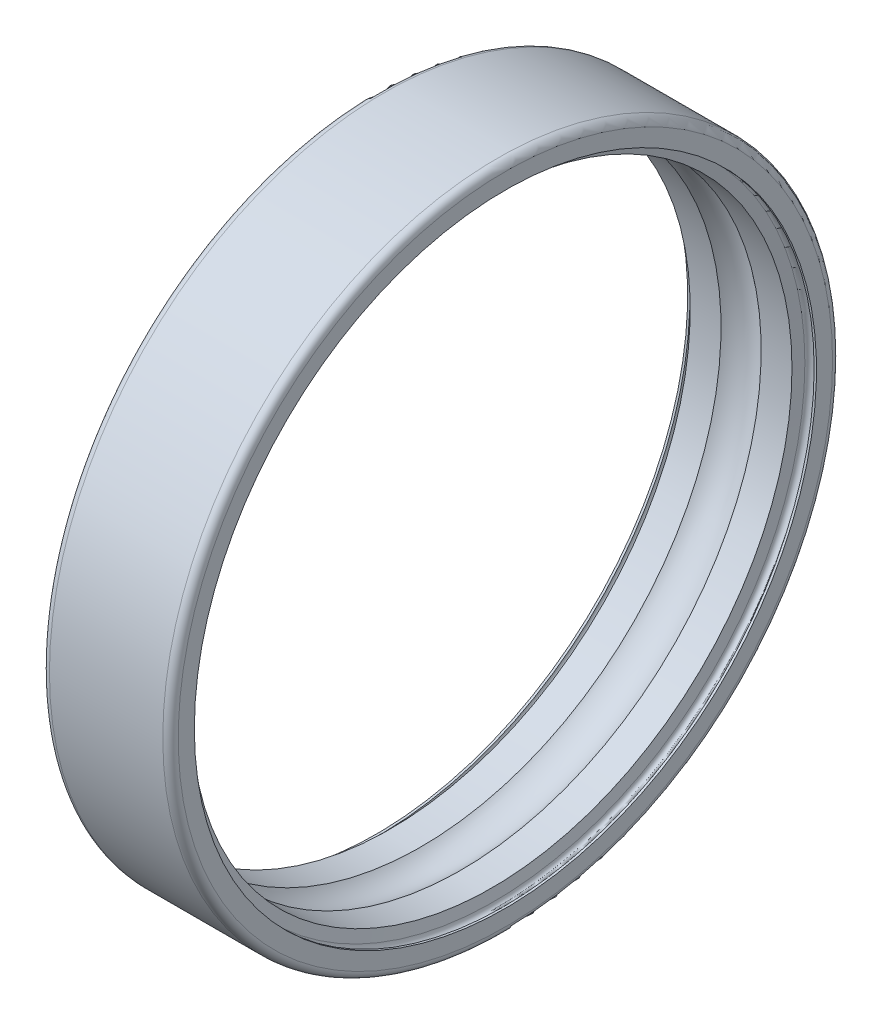
ISO-10303-21;
HEADER;
FILE_DESCRIPTION(('STEP AP214'),'2;1');
FILE_NAME('part.step','',(''),(''),'','','');
FILE_SCHEMA(('AUTOMOTIVE_DESIGN { 1 0 10303 214 1 1 1 1 }'));
ENDSEC;
DATA;
#1=APPLICATION_CONTEXT('core data for automotive mechanical design processes');
#2=APPLICATION_PROTOCOL_DEFINITION('international standard','automotive_design',2000,#1);
#3=PRODUCT_CONTEXT('',#1,'mechanical');
#4=PRODUCT('Part','Part','',(#3));
#5=PRODUCT_RELATED_PRODUCT_CATEGORY('part','',(#4));
#6=PRODUCT_DEFINITION_FORMATION('','',#4);
#7=PRODUCT_DEFINITION_CONTEXT('part definition',#1,'design');
#8=PRODUCT_DEFINITION('design','',#6,#7);
#9=PRODUCT_DEFINITION_SHAPE('','',#8);
#10=(LENGTH_UNIT() NAMED_UNIT(*) SI_UNIT(.MILLI.,.METRE.));
#11=(NAMED_UNIT(*) PLANE_ANGLE_UNIT() SI_UNIT($,.RADIAN.));
#12=(NAMED_UNIT(*) SI_UNIT($,.STERADIAN.) SOLID_ANGLE_UNIT());
#13=UNCERTAINTY_MEASURE_WITH_UNIT(LENGTH_MEASURE(1.E-05),#10,'distance_accuracy_value','');
#14=(GEOMETRIC_REPRESENTATION_CONTEXT(3) GLOBAL_UNCERTAINTY_ASSIGNED_CONTEXT((#13)) GLOBAL_UNIT_ASSIGNED_CONTEXT((#10,
#11,#12)) REPRESENTATION_CONTEXT('',''));
#15=CARTESIAN_POINT('',(0.,0.,0.));
#16=DIRECTION('',(0.,0.,1.));
#17=DIRECTION('',(1.,0.,0.));
#18=AXIS2_PLACEMENT_3D('',#15,#16,#17);
#19=CARTESIAN_POINT('',(2.5,0.,0.));
#20=DIRECTION('',(1.,0.,0.));
#21=DIRECTION('',(0.,0.,-1.));
#22=AXIS2_PLACEMENT_3D('',#19,#20,#21);
#23=TOROIDAL_SURFACE('',#22,10.75,1.1905);
#24=CARTESIAN_POINT('',(3.27928829710191,0.,0.));
#25=DIRECTION('',(-1.,0.,0.));
#26=DIRECTION('',(0.,0.,1.));
#27=AXIS2_PLACEMENT_3D('',#24,#25,#26);
#28=CIRCLE('',#27,11.65);
#29=CARTESIAN_POINT('',(3.27928829710191,0.,11.65));
#30=VERTEX_POINT('',#29);
#31=EDGE_CURVE('E124',#30,#30,#28,.F.);
#32=ORIENTED_EDGE('',*,*,#31,.T.);
#33=EDGE_LOOP('',(#32));
#34=FACE_BOUND('',#33,.T.);
#35=CARTESIAN_POINT('',(1.72071170289809,0.,0.));
#36=DIRECTION('',(-1.,0.,0.));
#37=DIRECTION('',(0.,0.,1.));
#38=AXIS2_PLACEMENT_3D('',#35,#36,#37);
#39=CIRCLE('',#38,11.65);
#40=CARTESIAN_POINT('',(1.72071170289809,0.,11.65));
#41=VERTEX_POINT('',#40);
#42=EDGE_CURVE('E129',#41,#41,#39,.T.);
#43=ORIENTED_EDGE('',*,*,#42,.T.);
#44=EDGE_LOOP('',(#43));
#45=FACE_BOUND('',#44,.T.);
#46=ADVANCED_FACE('F15',(#34,#45),#23,.F.);
#47=CARTESIAN_POINT('',(50.,0.,0.));
#48=DIRECTION('',(-1.,0.,0.));
#49=DIRECTION('',(0.,0.,1.));
#50=AXIS2_PLACEMENT_3D('',#47,#48,#49);
#51=CYLINDRICAL_SURFACE('',#50,11.65);
#52=CARTESIAN_POINT('',(0.524938966801098,0.,0.));
#53=DIRECTION('',(-1.,0.,0.));
#54=DIRECTION('',(0.,0.,1.));
#55=AXIS2_PLACEMENT_3D('',#52,#53,#54);
#56=CIRCLE('',#55,11.65);
#57=CARTESIAN_POINT('',(0.524938966801098,0.,11.65));
#58=VERTEX_POINT('',#57);
#59=EDGE_CURVE('E119',#58,#58,#56,.T.);
#60=ORIENTED_EDGE('',*,*,#59,.T.);
#61=EDGE_LOOP('',(#60));
#62=FACE_BOUND('',#61,.T.);
#63=ORIENTED_EDGE('',*,*,#42,.F.);
#64=EDGE_LOOP('',(#63));
#65=FACE_BOUND('',#64,.T.);
#66=ADVANCED_FACE('F243',(#62,#65),#51,.F.);
#67=CARTESIAN_POINT('',(50.,0.,0.));
#68=DIRECTION('',(-1.,0.,0.));
#69=DIRECTION('',(0.,0.,1.));
#70=AXIS2_PLACEMENT_3D('',#67,#68,#69);
#71=CYLINDRICAL_SURFACE('',#70,11.65);
#72=ORIENTED_EDGE('',*,*,#31,.F.);
#73=EDGE_LOOP('',(#72));
#74=FACE_BOUND('',#73,.T.);
#75=CARTESIAN_POINT('',(4.4750610331989,0.,0.));
#76=DIRECTION('',(1.,0.,0.));
#77=DIRECTION('',(0.,0.,-1.));
#78=AXIS2_PLACEMENT_3D('',#75,#76,#77);
#79=CIRCLE('',#78,11.65);
#80=CARTESIAN_POINT('',(4.4750610331989,0.,-11.65));
#81=VERTEX_POINT('',#80);
#82=EDGE_CURVE('E114',#81,#81,#79,.T.);
#83=ORIENTED_EDGE('',*,*,#82,.T.);
#84=EDGE_LOOP('',(#83));
#85=FACE_BOUND('',#84,.T.);
#86=ADVANCED_FACE('F233',(#74,#85),#71,.F.);
#87=CARTESIAN_POINT('',(0.449999999999999,0.,0.));
#88=DIRECTION('',(-1.,0.,0.));
#89=DIRECTION('',(0.,0.,1.));
#90=AXIS2_PLACEMENT_3D('',#87,#88,#89);
#91=CONICAL_SURFACE('',#90,12.075,1.39626340159546);
#92=CARTESIAN_POINT('',(0.45,0.,0.));
#93=DIRECTION('',(1.,0.,0.));
#94=DIRECTION('',(0.,0.,-1.));
#95=AXIS2_PLACEMENT_3D('',#92,#93,#94);
#96=CIRCLE('',#95,12.075);
#97=CARTESIAN_POINT('',(0.45,0.,-12.075));
#98=VERTEX_POINT('',#97);
#99=EDGE_CURVE('E108',#98,#98,#96,.F.);
#100=ORIENTED_EDGE('',*,*,#99,.T.);
#101=EDGE_LOOP('',(#100));
#102=FACE_BOUND('',#101,.T.);
#103=ORIENTED_EDGE('',*,*,#59,.F.);
#104=EDGE_LOOP('',(#103));
#105=FACE_BOUND('',#104,.T.);
#106=ADVANCED_FACE('F167',(#102,#105),#91,.F.);
#107=CARTESIAN_POINT('',(4.55,0.,0.));
#108=DIRECTION('',(1.,0.,0.));
#109=DIRECTION('',(0.,0.,-1.));
#110=AXIS2_PLACEMENT_3D('',#107,#108,#109);
#111=CONICAL_SURFACE('',#110,12.075,1.39626340159547);
#112=ORIENTED_EDGE('',*,*,#82,.F.);
#113=EDGE_LOOP('',(#112));
#114=FACE_BOUND('',#113,.T.);
#115=CARTESIAN_POINT('',(4.55,0.,0.));
#116=DIRECTION('',(1.,0.,0.));
#117=DIRECTION('',(0.,0.,-1.));
#118=AXIS2_PLACEMENT_3D('',#115,#116,#117);
#119=CIRCLE('',#118,12.075);
#120=CARTESIAN_POINT('',(4.55,0.,-12.075));
#121=VERTEX_POINT('',#120);
#122=EDGE_CURVE('E104',#121,#121,#119,.T.);
#123=ORIENTED_EDGE('',*,*,#122,.T.);
#124=EDGE_LOOP('',(#123));
#125=FACE_BOUND('',#124,.T.);
#126=ADVANCED_FACE('F161',(#114,#125),#111,.F.);
#127=CARTESIAN_POINT('',(0.27,0.,0.));
#128=DIRECTION('',(1.,0.,0.));
#129=DIRECTION('',(0.,0.,-1.));
#130=AXIS2_PLACEMENT_3D('',#127,#128,#129);
#131=TOROIDAL_SURFACE('',#130,12.075,0.18);
#132=ORIENTED_EDGE('',*,*,#99,.F.);
#133=EDGE_LOOP('',(#132));
#134=FACE_BOUND('',#133,.T.);
#135=CARTESIAN_POINT('',(0.0899999999999998,0.,0.));
#136=DIRECTION('',(-1.,0.,0.));
#137=DIRECTION('',(0.,0.,1.));
#138=AXIS2_PLACEMENT_3D('',#135,#136,#137);
#139=CIRCLE('',#138,12.075);
#140=CARTESIAN_POINT('',(0.0899999999999998,0.,12.075));
#141=VERTEX_POINT('',#140);
#142=EDGE_CURVE('E107',#141,#141,#139,.T.);
#143=ORIENTED_EDGE('',*,*,#142,.T.);
#144=EDGE_LOOP('',(#143));
#145=FACE_BOUND('',#144,.T.);
#146=ADVANCED_FACE('F95',(#134,#145),#131,.F.);
#147=CARTESIAN_POINT('',(4.73,0.,0.));
#148=DIRECTION('',(1.,0.,0.));
#149=DIRECTION('',(0.,0.,-1.));
#150=AXIS2_PLACEMENT_3D('',#147,#148,#149);
#151=TOROIDAL_SURFACE('',#150,12.075,0.18);
#152=CARTESIAN_POINT('',(4.91,0.,0.));
#153=DIRECTION('',(-1.,0.,0.));
#154=DIRECTION('',(0.,0.,1.));
#155=AXIS2_PLACEMENT_3D('',#152,#153,#154);
#156=CIRCLE('',#155,12.075);
#157=CARTESIAN_POINT('',(4.91,0.,12.075));
#158=VERTEX_POINT('',#157);
#159=EDGE_CURVE('E141',#158,#158,#156,.F.);
#160=ORIENTED_EDGE('',*,*,#159,.T.);
#161=EDGE_LOOP('',(#160));
#162=FACE_BOUND('',#161,.T.);
#163=ORIENTED_EDGE('',*,*,#122,.F.);
#164=EDGE_LOOP('',(#163));
#165=FACE_BOUND('',#164,.T.);
#166=ADVANCED_FACE('F90',(#162,#165),#151,.F.);
#167=CARTESIAN_POINT('',(50.,0.,0.));
#168=DIRECTION('',(-1.,0.,0.));
#169=DIRECTION('',(0.,0.,1.));
#170=AXIS2_PLACEMENT_3D('',#167,#168,#169);
#171=CYLINDRICAL_SURFACE('',#170,12.075);
#172=CARTESIAN_POINT('',(0.,0.,0.));
#173=DIRECTION('',(-1.,0.,0.));
#174=DIRECTION('',(0.,0.,1.));
#175=AXIS2_PLACEMENT_3D('',#172,#173,#174);
#176=CIRCLE('',#175,12.075);
#177=CARTESIAN_POINT('',(0.,0.,12.075));
#178=VERTEX_POINT('',#177);
#179=EDGE_CURVE('E19',#178,#178,#176,.F.);
#180=ORIENTED_EDGE('',*,*,#179,.F.);
#181=EDGE_LOOP('',(#180));
#182=FACE_BOUND('',#181,.T.);
#183=ORIENTED_EDGE('',*,*,#142,.F.);
#184=EDGE_LOOP('',(#183));
#185=FACE_BOUND('',#184,.T.);
#186=ADVANCED_FACE('F86',(#182,#185),#171,.F.);
#187=CARTESIAN_POINT('',(50.,0.,0.));
#188=DIRECTION('',(-1.,0.,0.));
#189=DIRECTION('',(0.,0.,1.));
#190=AXIS2_PLACEMENT_3D('',#187,#188,#189);
#191=CYLINDRICAL_SURFACE('',#190,12.075);
#192=ORIENTED_EDGE('',*,*,#159,.F.);
#193=EDGE_LOOP('',(#192));
#194=FACE_BOUND('',#193,.T.);
#195=CARTESIAN_POINT('',(5.,0.,0.));
#196=DIRECTION('',(-1.,0.,0.));
#197=DIRECTION('',(0.,0.,1.));
#198=AXIS2_PLACEMENT_3D('',#195,#196,#197);
#199=CIRCLE('',#198,12.075);
#200=CARTESIAN_POINT('',(5.,0.,12.075));
#201=VERTEX_POINT('',#200);
#202=EDGE_CURVE('E136',#201,#201,#199,.T.);
#203=ORIENTED_EDGE('',*,*,#202,.F.);
#204=EDGE_LOOP('',(#203));
#205=FACE_BOUND('',#204,.T.);
#206=ADVANCED_FACE('F82',(#194,#205),#191,.F.);
#207=CARTESIAN_POINT('',(0.,12.7,0.));
#208=DIRECTION('',(-1.,0.,0.));
#209=DIRECTION('',(0.,0.,1.));
#210=AXIS2_PLACEMENT_3D('',#207,#208,#209);
#211=PLANE('',#210);
#212=CARTESIAN_POINT('',(0.,0.,0.));
#213=DIRECTION('',(1.,0.,0.));
#214=DIRECTION('',(0.,0.,-1.));
#215=AXIS2_PLACEMENT_3D('',#212,#213,#214);
#216=CIRCLE('',#215,12.7);
#217=CARTESIAN_POINT('',(0.,0.,-12.7));
#218=VERTEX_POINT('',#217);
#219=EDGE_CURVE('E66',#218,#218,#216,.T.);
#220=ORIENTED_EDGE('',*,*,#219,.F.);
#221=EDGE_LOOP('',(#220));
#222=FACE_BOUND('',#221,.T.);
#223=ORIENTED_EDGE('',*,*,#179,.T.);
#224=EDGE_LOOP('',(#223));
#225=FACE_BOUND('',#224,.T.);
#226=ADVANCED_FACE('F72',(#222,#225),#211,.T.);
#227=CARTESIAN_POINT('',(5.,12.075,0.));
#228=DIRECTION('',(1.,0.,0.));
#229=DIRECTION('',(0.,0.,-1.));
#230=AXIS2_PLACEMENT_3D('',#227,#228,#229);
#231=PLANE('',#230);
#232=ORIENTED_EDGE('',*,*,#202,.T.);
#233=EDGE_LOOP('',(#232));
#234=FACE_BOUND('',#233,.T.);
#235=CARTESIAN_POINT('',(5.,0.,0.));
#236=DIRECTION('',(-1.,0.,0.));
#237=DIRECTION('',(0.,0.,-1.));
#238=AXIS2_PLACEMENT_3D('',#235,#236,#237);
#239=CIRCLE('',#238,12.7);
#240=CARTESIAN_POINT('',(5.,0.,-12.7));
#241=VERTEX_POINT('',#240);
#242=EDGE_CURVE('E28',#241,#241,#239,.T.);
#243=ORIENTED_EDGE('',*,*,#242,.F.);
#244=EDGE_LOOP('',(#243));
#245=FACE_BOUND('',#244,.T.);
#246=ADVANCED_FACE('F81',(#234,#245),#231,.T.);
#247=CARTESIAN_POINT('',(0.300000000000002,0.,0.));
#248=DIRECTION('',(1.,0.,0.));
#249=DIRECTION('',(0.,0.,-1.));
#250=AXIS2_PLACEMENT_3D('',#247,#248,#249);
#251=TOROIDAL_SURFACE('',#250,12.7,0.300000000000002);
#252=CARTESIAN_POINT('',(0.300000000000002,0.,0.));
#253=DIRECTION('',(-1.,0.,0.));
#254=DIRECTION('',(0.,0.,1.));
#255=AXIS2_PLACEMENT_3D('',#252,#253,#254);
#256=CIRCLE('',#255,13.);
#257=CARTESIAN_POINT('',(0.300000000000002,0.,13.));
#258=VERTEX_POINT('',#257);
#259=EDGE_CURVE('E23',#258,#258,#256,.F.);
#260=ORIENTED_EDGE('',*,*,#259,.F.);
#261=EDGE_LOOP('',(#260));
#262=FACE_BOUND('',#261,.T.);
#263=ORIENTED_EDGE('',*,*,#219,.T.);
#264=EDGE_LOOP('',(#263));
#265=FACE_BOUND('',#264,.T.);
#266=ADVANCED_FACE('F46',(#262,#265),#251,.T.);
#267=CARTESIAN_POINT('',(4.7,0.,0.));
#268=DIRECTION('',(1.,0.,0.));
#269=DIRECTION('',(0.,0.,-1.));
#270=AXIS2_PLACEMENT_3D('',#267,#268,#269);
#271=TOROIDAL_SURFACE('',#270,12.7,0.300000000000003);
#272=ORIENTED_EDGE('',*,*,#242,.T.);
#273=EDGE_LOOP('',(#272));
#274=FACE_BOUND('',#273,.T.);
#275=CARTESIAN_POINT('',(4.7,0.,0.));
#276=DIRECTION('',(-1.,0.,0.));
#277=DIRECTION('',(0.,0.,1.));
#278=AXIS2_PLACEMENT_3D('',#275,#276,#277);
#279=CIRCLE('',#278,13.);
#280=CARTESIAN_POINT('',(4.7,0.,13.));
#281=VERTEX_POINT('',#280);
#282=EDGE_CURVE('E10',#281,#281,#279,.T.);
#283=ORIENTED_EDGE('',*,*,#282,.F.);
#284=EDGE_LOOP('',(#283));
#285=FACE_BOUND('',#284,.T.);
#286=ADVANCED_FACE('F40',(#274,#285),#271,.T.);
#287=CARTESIAN_POINT('',(50.,0.,0.));
#288=DIRECTION('',(-1.,0.,0.));
#289=DIRECTION('',(0.,0.,1.));
#290=AXIS2_PLACEMENT_3D('',#287,#288,#289);
#291=CYLINDRICAL_SURFACE('',#290,13.);
#292=ORIENTED_EDGE('',*,*,#282,.T.);
#293=EDGE_LOOP('',(#292));
#294=FACE_BOUND('',#293,.T.);
#295=ORIENTED_EDGE('',*,*,#259,.T.);
#296=EDGE_LOOP('',(#295));
#297=FACE_BOUND('',#296,.T.);
#298=ADVANCED_FACE('F45',(#294,#297),#291,.T.);
#299=CLOSED_SHELL('',(#46,#66,#86,#106,#126,#146,#166,#186,#206,#226,#246,#266,#286,#298));
#300=MANIFOLD_SOLID_BREP('B1',#299);
#301=ADVANCED_BREP_SHAPE_REPRESENTATION('',(#18,#300),#14);
#302=SHAPE_DEFINITION_REPRESENTATION(#9,#301);
ENDSEC;
END-ISO-10303-21;
